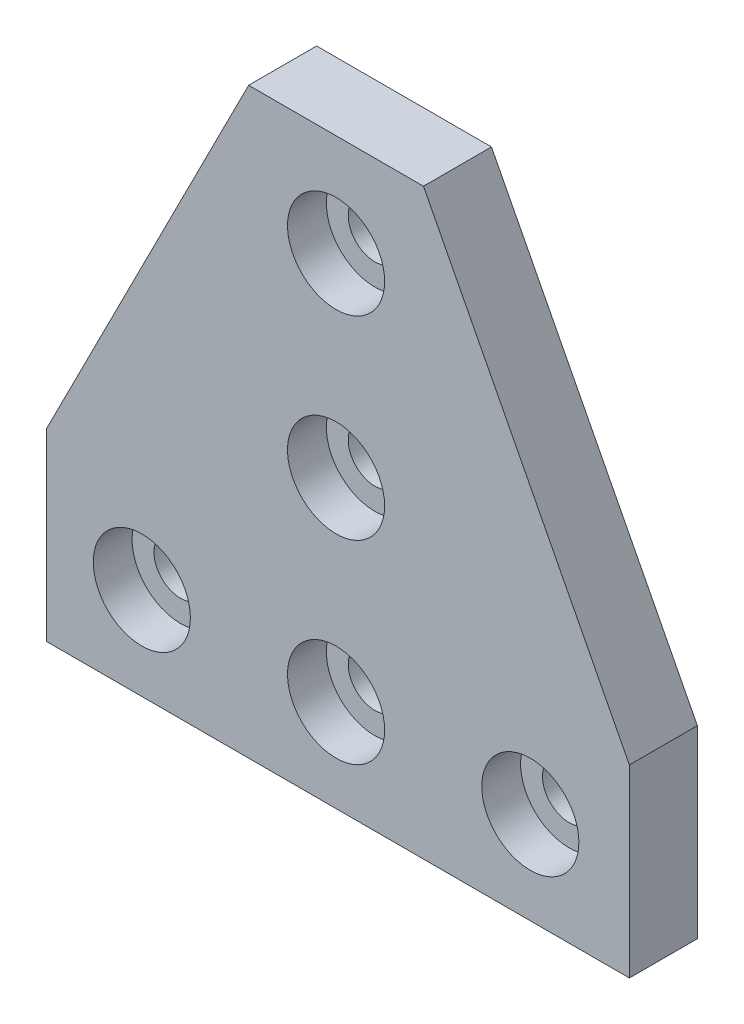
ISO-10303-21;
HEADER;
FILE_DESCRIPTION(('STEP AP214'),'2;1');
FILE_NAME('part.step','',(''),(''),'','','');
FILE_SCHEMA(('AUTOMOTIVE_DESIGN { 1 0 10303 214 1 1 1 1 }'));
ENDSEC;
DATA;
#1=APPLICATION_CONTEXT('core data for automotive mechanical design processes');
#2=APPLICATION_PROTOCOL_DEFINITION('international standard','automotive_design',2000,#1);
#3=PRODUCT_CONTEXT('',#1,'mechanical');
#4=PRODUCT('Part','Part','',(#3));
#5=PRODUCT_RELATED_PRODUCT_CATEGORY('part','',(#4));
#6=PRODUCT_DEFINITION_FORMATION('','',#4);
#7=PRODUCT_DEFINITION_CONTEXT('part definition',#1,'design');
#8=PRODUCT_DEFINITION('design','',#6,#7);
#9=PRODUCT_DEFINITION_SHAPE('','',#8);
#10=(LENGTH_UNIT() NAMED_UNIT(*) SI_UNIT(.MILLI.,.METRE.));
#11=(NAMED_UNIT(*) PLANE_ANGLE_UNIT() SI_UNIT($,.RADIAN.));
#12=(NAMED_UNIT(*) SI_UNIT($,.STERADIAN.) SOLID_ANGLE_UNIT());
#13=UNCERTAINTY_MEASURE_WITH_UNIT(LENGTH_MEASURE(1.E-05),#10,'distance_accuracy_value','');
#14=(GEOMETRIC_REPRESENTATION_CONTEXT(3) GLOBAL_UNCERTAINTY_ASSIGNED_CONTEXT((#13)) GLOBAL_UNIT_ASSIGNED_CONTEXT((#10,
#11,#12)) REPRESENTATION_CONTEXT('',''));
#15=CARTESIAN_POINT('',(0.,0.,0.));
#16=DIRECTION('',(0.,0.,1.));
#17=DIRECTION('',(1.,0.,0.));
#18=AXIS2_PLACEMENT_3D('',#15,#16,#17);
#19=CARTESIAN_POINT('',(0.200065786,20.5,0.));
#20=DIRECTION('',(0.,0.,1.));
#21=DIRECTION('',(1.,0.,0.));
#22=AXIS2_PLACEMENT_3D('',#19,#20,#21);
#23=PLANE('',#22);
#24=CARTESIAN_POINT('',(-20.,0.,0.));
#25=DIRECTION('',(0.,0.,-1.));
#26=DIRECTION('',(-1.,0.,0.));
#27=AXIS2_PLACEMENT_3D('',#24,#25,#26);
#28=CIRCLE('',#27,2.75);
#29=CARTESIAN_POINT('',(-17.25,0.,0.));
#30=VERTEX_POINT('',#29);
#31=EDGE_CURVE('E207',#30,#30,#28,.T.);
#32=ORIENTED_EDGE('',*,*,#31,.F.);
#33=EDGE_LOOP('',(#32));
#34=FACE_BOUND('',#33,.T.);
#35=CARTESIAN_POINT('',(0.,0.,0.));
#36=DIRECTION('',(0.,0.,-1.));
#37=DIRECTION('',(-1.,0.,0.));
#38=AXIS2_PLACEMENT_3D('',#35,#36,#37);
#39=CIRCLE('',#38,2.75);
#40=CARTESIAN_POINT('',(2.75,0.,0.));
#41=VERTEX_POINT('',#40);
#42=EDGE_CURVE('E305',#41,#41,#39,.T.);
#43=ORIENTED_EDGE('',*,*,#42,.F.);
#44=EDGE_LOOP('',(#43));
#45=FACE_BOUND('',#44,.T.);
#46=CARTESIAN_POINT('',(20.,0.,0.));
#47=DIRECTION('',(0.,0.,-1.));
#48=DIRECTION('',(-1.,0.,0.));
#49=AXIS2_PLACEMENT_3D('',#46,#47,#48);
#50=CIRCLE('',#49,2.75);
#51=CARTESIAN_POINT('',(22.75,0.,0.));
#52=VERTEX_POINT('',#51);
#53=EDGE_CURVE('E20',#52,#52,#50,.T.);
#54=ORIENTED_EDGE('',*,*,#53,.F.);
#55=EDGE_LOOP('',(#54));
#56=FACE_BOUND('',#55,.T.);
#57=CARTESIAN_POINT('',(0.,40.,0.));
#58=DIRECTION('',(0.,0.,-1.));
#59=DIRECTION('',(-1.,0.,0.));
#60=AXIS2_PLACEMENT_3D('',#57,#58,#59);
#61=CIRCLE('',#60,2.75);
#62=CARTESIAN_POINT('',(2.75,40.,0.));
#63=VERTEX_POINT('',#62);
#64=EDGE_CURVE('E256',#63,#63,#61,.T.);
#65=ORIENTED_EDGE('',*,*,#64,.F.);
#66=EDGE_LOOP('',(#65));
#67=FACE_BOUND('',#66,.T.);
#68=CARTESIAN_POINT('',(0.,20.,0.));
#69=DIRECTION('',(0.,0.,-1.));
#70=DIRECTION('',(-1.,0.,0.));
#71=AXIS2_PLACEMENT_3D('',#68,#69,#70);
#72=CIRCLE('',#71,2.75);
#73=CARTESIAN_POINT('',(2.75,20.,0.));
#74=VERTEX_POINT('',#73);
#75=EDGE_CURVE('E216',#74,#74,#72,.T.);
#76=ORIENTED_EDGE('',*,*,#75,.F.);
#77=EDGE_LOOP('',(#76));
#78=FACE_BOUND('',#77,.T.);
#79=DIRECTION('',(1.,0.,0.));
#80=VECTOR('',#79,1.);
#81=CARTESIAN_POINT('',(-29.799934214,-9.5,0.));
#82=LINE('',#81,#80);
#83=CARTESIAN_POINT('',(-29.799934214,-9.5,0.));
#84=VERTEX_POINT('',#83);
#85=CARTESIAN_POINT('',(30.200065786,-9.5,0.));
#86=VERTEX_POINT('',#85);
#87=EDGE_CURVE('E27',#84,#86,#82,.T.);
#88=ORIENTED_EDGE('',*,*,#87,.F.);
#89=DIRECTION('',(0.,-1.,0.));
#90=VECTOR('',#89,1.);
#91=CARTESIAN_POINT('',(-29.799934214,9.5,0.));
#92=LINE('',#91,#90);
#93=CARTESIAN_POINT('',(-29.799934214,9.5,0.));
#94=VERTEX_POINT('',#93);
#95=EDGE_CURVE('E208',#94,#84,#92,.T.);
#96=ORIENTED_EDGE('',*,*,#95,.F.);
#97=DIRECTION('',(-0.452425144121183,-0.891802382238872,0.));
#98=VECTOR('',#97,1.);
#99=CARTESIAN_POINT('',(-9.,50.5,0.));
#100=LINE('',#99,#98);
#101=CARTESIAN_POINT('',(-9.,50.5,0.));
#102=VERTEX_POINT('',#101);
#103=EDGE_CURVE('E276',#102,#94,#100,.T.);
#104=ORIENTED_EDGE('',*,*,#103,.F.);
#105=DIRECTION('',(-1.,0.,0.));
#106=VECTOR('',#105,1.);
#107=CARTESIAN_POINT('',(9.,50.5,0.));
#108=LINE('',#107,#106);
#109=CARTESIAN_POINT('',(9.,50.5,0.));
#110=VERTEX_POINT('',#109);
#111=EDGE_CURVE('E221',#110,#102,#108,.T.);
#112=ORIENTED_EDGE('',*,*,#111,.F.);
#113=DIRECTION('',(-0.459306160768736,0.888278025552746,0.));
#114=VECTOR('',#113,1.);
#115=CARTESIAN_POINT('',(30.200065786,9.5,0.));
#116=LINE('',#115,#114);
#117=CARTESIAN_POINT('',(30.200065786,9.5,0.));
#118=VERTEX_POINT('',#117);
#119=EDGE_CURVE('E182',#118,#110,#116,.T.);
#120=ORIENTED_EDGE('',*,*,#119,.F.);
#121=DIRECTION('',(0.,1.,0.));
#122=VECTOR('',#121,1.);
#123=CARTESIAN_POINT('',(30.200065786,-9.5,0.));
#124=LINE('',#123,#122);
#125=EDGE_CURVE('E242',#86,#118,#124,.T.);
#126=ORIENTED_EDGE('',*,*,#125,.F.);
#127=EDGE_LOOP('',(#88,#96,#104,#112,#120,#126));
#128=FACE_BOUND('',#127,.T.);
#129=ADVANCED_FACE('F16',(#34,#45,#56,#67,#78,#128),#23,.F.);
#130=CARTESIAN_POINT('',(0.200065786,20.5,7.));
#131=DIRECTION('',(0.,0.,1.));
#132=DIRECTION('',(1.,0.,0.));
#133=AXIS2_PLACEMENT_3D('',#130,#131,#132);
#134=PLANE('',#133);
#135=DIRECTION('',(-1.,0.,0.));
#136=VECTOR('',#135,1.);
#137=CARTESIAN_POINT('',(-29.799934214,-9.5,7.));
#138=LINE('',#137,#136);
#139=CARTESIAN_POINT('',(30.200065786,-9.5,7.));
#140=VERTEX_POINT('',#139);
#141=CARTESIAN_POINT('',(-29.799934214,-9.5,7.));
#142=VERTEX_POINT('',#141);
#143=EDGE_CURVE('E10',#140,#142,#138,.T.);
#144=ORIENTED_EDGE('',*,*,#143,.F.);
#145=DIRECTION('',(0.,-1.,0.));
#146=VECTOR('',#145,1.);
#147=CARTESIAN_POINT('',(30.200065786,-9.5,7.));
#148=LINE('',#147,#146);
#149=CARTESIAN_POINT('',(30.200065786,9.5,7.));
#150=VERTEX_POINT('',#149);
#151=EDGE_CURVE('E233',#150,#140,#148,.T.);
#152=ORIENTED_EDGE('',*,*,#151,.F.);
#153=DIRECTION('',(0.459306160768736,-0.888278025552746,0.));
#154=VECTOR('',#153,1.);
#155=CARTESIAN_POINT('',(30.200065786,9.5,7.));
#156=LINE('',#155,#154);
#157=CARTESIAN_POINT('',(9.,50.5,7.));
#158=VERTEX_POINT('',#157);
#159=EDGE_CURVE('E185',#158,#150,#156,.T.);
#160=ORIENTED_EDGE('',*,*,#159,.F.);
#161=DIRECTION('',(1.,0.,0.));
#162=VECTOR('',#161,1.);
#163=CARTESIAN_POINT('',(9.,50.5,7.));
#164=LINE('',#163,#162);
#165=CARTESIAN_POINT('',(-9.,50.5,7.));
#166=VERTEX_POINT('',#165);
#167=EDGE_CURVE('E265',#166,#158,#164,.T.);
#168=ORIENTED_EDGE('',*,*,#167,.F.);
#169=DIRECTION('',(0.452425144121183,0.891802382238872,0.));
#170=VECTOR('',#169,1.);
#171=CARTESIAN_POINT('',(-9.,50.5,7.));
#172=LINE('',#171,#170);
#173=CARTESIAN_POINT('',(-29.799934214,9.5,7.));
#174=VERTEX_POINT('',#173);
#175=EDGE_CURVE('E222',#174,#166,#172,.T.);
#176=ORIENTED_EDGE('',*,*,#175,.F.);
#177=DIRECTION('',(0.,1.,0.));
#178=VECTOR('',#177,1.);
#179=CARTESIAN_POINT('',(-29.799934214,9.5,7.));
#180=LINE('',#179,#178);
#181=EDGE_CURVE('E229',#142,#174,#180,.T.);
#182=ORIENTED_EDGE('',*,*,#181,.F.);
#183=EDGE_LOOP('',(#144,#152,#160,#168,#176,#182));
#184=FACE_BOUND('',#183,.T.);
#185=CARTESIAN_POINT('',(0.,40.,7.));
#186=DIRECTION('',(0.,0.,1.));
#187=DIRECTION('',(1.,0.,0.));
#188=AXIS2_PLACEMENT_3D('',#185,#186,#187);
#189=CIRCLE('',#188,5.);
#190=CARTESIAN_POINT('',(5.,40.,7.));
#191=VERTEX_POINT('',#190);
#192=EDGE_CURVE('E162',#191,#191,#189,.T.);
#193=ORIENTED_EDGE('',*,*,#192,.F.);
#194=EDGE_LOOP('',(#193));
#195=FACE_BOUND('',#194,.T.);
#196=CARTESIAN_POINT('',(-20.,0.,7.));
#197=DIRECTION('',(0.,0.,1.));
#198=DIRECTION('',(1.,0.,0.));
#199=AXIS2_PLACEMENT_3D('',#196,#197,#198);
#200=CIRCLE('',#199,5.);
#201=CARTESIAN_POINT('',(-15.,0.,7.));
#202=VERTEX_POINT('',#201);
#203=EDGE_CURVE('E197',#202,#202,#200,.T.);
#204=ORIENTED_EDGE('',*,*,#203,.F.);
#205=EDGE_LOOP('',(#204));
#206=FACE_BOUND('',#205,.T.);
#207=CARTESIAN_POINT('',(0.,20.,7.));
#208=DIRECTION('',(0.,0.,1.));
#209=DIRECTION('',(1.,0.,0.));
#210=AXIS2_PLACEMENT_3D('',#207,#208,#209);
#211=CIRCLE('',#210,5.);
#212=CARTESIAN_POINT('',(5.,20.,7.));
#213=VERTEX_POINT('',#212);
#214=EDGE_CURVE('E295',#213,#213,#211,.T.);
#215=ORIENTED_EDGE('',*,*,#214,.F.);
#216=EDGE_LOOP('',(#215));
#217=FACE_BOUND('',#216,.T.);
#218=CARTESIAN_POINT('',(20.,0.,7.));
#219=DIRECTION('',(0.,0.,1.));
#220=DIRECTION('',(1.,0.,0.));
#221=AXIS2_PLACEMENT_3D('',#218,#219,#220);
#222=CIRCLE('',#221,5.);
#223=CARTESIAN_POINT('',(25.,0.,7.));
#224=VERTEX_POINT('',#223);
#225=EDGE_CURVE('E338',#224,#224,#222,.T.);
#226=ORIENTED_EDGE('',*,*,#225,.F.);
#227=EDGE_LOOP('',(#226));
#228=FACE_BOUND('',#227,.T.);
#229=CARTESIAN_POINT('',(0.,0.,7.));
#230=DIRECTION('',(0.,0.,1.));
#231=DIRECTION('',(1.,0.,0.));
#232=AXIS2_PLACEMENT_3D('',#229,#230,#231);
#233=CIRCLE('',#232,5.);
#234=CARTESIAN_POINT('',(5.,0.,7.));
#235=VERTEX_POINT('',#234);
#236=EDGE_CURVE('E330',#235,#235,#233,.T.);
#237=ORIENTED_EDGE('',*,*,#236,.F.);
#238=EDGE_LOOP('',(#237));
#239=FACE_BOUND('',#238,.T.);
#240=ADVANCED_FACE('F385',(#184,#195,#206,#217,#228,#239),#134,.T.);
#241=CARTESIAN_POINT('',(-29.799934214,-9.5,0.));
#242=DIRECTION('',(0.,-1.,0.));
#243=DIRECTION('',(0.,0.,-1.));
#244=AXIS2_PLACEMENT_3D('',#241,#242,#243);
#245=PLANE('',#244);
#246=ORIENTED_EDGE('',*,*,#87,.T.);
#247=DIRECTION('',(0.,0.,-1.));
#248=VECTOR('',#247,1.);
#249=CARTESIAN_POINT('',(30.200065786,-9.5,0.));
#250=LINE('',#249,#248);
#251=EDGE_CURVE('E230',#140,#86,#250,.T.);
#252=ORIENTED_EDGE('',*,*,#251,.F.);
#253=ORIENTED_EDGE('',*,*,#143,.T.);
#254=DIRECTION('',(0.,0.,1.));
#255=VECTOR('',#254,1.);
#256=CARTESIAN_POINT('',(-29.799934214,-9.5,0.));
#257=LINE('',#256,#255);
#258=EDGE_CURVE('E215',#84,#142,#257,.T.);
#259=ORIENTED_EDGE('',*,*,#258,.F.);
#260=EDGE_LOOP('',(#246,#252,#253,#259));
#261=FACE_BOUND('',#260,.T.);
#262=ADVANCED_FACE('F393',(#261),#245,.T.);
#263=CARTESIAN_POINT('',(30.200065786,-9.5,0.));
#264=DIRECTION('',(1.,0.,0.));
#265=DIRECTION('',(0.,1.,0.));
#266=AXIS2_PLACEMENT_3D('',#263,#264,#265);
#267=PLANE('',#266);
#268=ORIENTED_EDGE('',*,*,#125,.T.);
#269=DIRECTION('',(0.,0.,-1.));
#270=VECTOR('',#269,1.);
#271=CARTESIAN_POINT('',(30.200065786,9.5,0.));
#272=LINE('',#271,#270);
#273=EDGE_CURVE('E248',#150,#118,#272,.T.);
#274=ORIENTED_EDGE('',*,*,#273,.F.);
#275=ORIENTED_EDGE('',*,*,#151,.T.);
#276=ORIENTED_EDGE('',*,*,#251,.T.);
#277=EDGE_LOOP('',(#268,#274,#275,#276));
#278=FACE_BOUND('',#277,.T.);
#279=ADVANCED_FACE('F408',(#278),#267,.T.);
#280=CARTESIAN_POINT('',(30.200065786,9.5,0.));
#281=DIRECTION('',(0.888278025552746,0.459306160768736,0.));
#282=DIRECTION('',(0.,0.,-1.));
#283=AXIS2_PLACEMENT_3D('',#280,#281,#282);
#284=PLANE('',#283);
#285=ORIENTED_EDGE('',*,*,#119,.T.);
#286=DIRECTION('',(0.,0.,-1.));
#287=VECTOR('',#286,1.);
#288=CARTESIAN_POINT('',(9.,50.5,0.));
#289=LINE('',#288,#287);
#290=EDGE_CURVE('E186',#158,#110,#289,.T.);
#291=ORIENTED_EDGE('',*,*,#290,.F.);
#292=ORIENTED_EDGE('',*,*,#159,.T.);
#293=ORIENTED_EDGE('',*,*,#273,.T.);
#294=EDGE_LOOP('',(#285,#291,#292,#293));
#295=FACE_BOUND('',#294,.T.);
#296=ADVANCED_FACE('F407',(#295),#284,.T.);
#297=CARTESIAN_POINT('',(9.,50.5,0.));
#298=DIRECTION('',(0.,1.,0.));
#299=DIRECTION('',(1.,0.,0.));
#300=AXIS2_PLACEMENT_3D('',#297,#298,#299);
#301=PLANE('',#300);
#302=ORIENTED_EDGE('',*,*,#111,.T.);
#303=DIRECTION('',(0.,0.,-1.));
#304=VECTOR('',#303,1.);
#305=CARTESIAN_POINT('',(-9.,50.5,0.));
#306=LINE('',#305,#304);
#307=EDGE_CURVE('E217',#166,#102,#306,.T.);
#308=ORIENTED_EDGE('',*,*,#307,.F.);
#309=ORIENTED_EDGE('',*,*,#167,.T.);
#310=ORIENTED_EDGE('',*,*,#290,.T.);
#311=EDGE_LOOP('',(#302,#308,#309,#310));
#312=FACE_BOUND('',#311,.T.);
#313=ADVANCED_FACE('F404',(#312),#301,.T.);
#314=CARTESIAN_POINT('',(-9.,50.5,0.));
#315=DIRECTION('',(-0.891802382238872,0.452425144121183,0.));
#316=DIRECTION('',(0.,0.,1.));
#317=AXIS2_PLACEMENT_3D('',#314,#315,#316);
#318=PLANE('',#317);
#319=ORIENTED_EDGE('',*,*,#103,.T.);
#320=DIRECTION('',(0.,0.,-1.));
#321=VECTOR('',#320,1.);
#322=CARTESIAN_POINT('',(-29.799934214,9.5,0.));
#323=LINE('',#322,#321);
#324=EDGE_CURVE('E274',#174,#94,#323,.T.);
#325=ORIENTED_EDGE('',*,*,#324,.F.);
#326=ORIENTED_EDGE('',*,*,#175,.T.);
#327=ORIENTED_EDGE('',*,*,#307,.T.);
#328=EDGE_LOOP('',(#319,#325,#326,#327));
#329=FACE_BOUND('',#328,.T.);
#330=ADVANCED_FACE('F18',(#329),#318,.T.);
#331=CARTESIAN_POINT('',(-29.799934214,9.5,0.));
#332=DIRECTION('',(-1.,0.,0.));
#333=DIRECTION('',(0.,1.,0.));
#334=AXIS2_PLACEMENT_3D('',#331,#332,#333);
#335=PLANE('',#334);
#336=ORIENTED_EDGE('',*,*,#95,.T.);
#337=ORIENTED_EDGE('',*,*,#258,.T.);
#338=ORIENTED_EDGE('',*,*,#181,.T.);
#339=ORIENTED_EDGE('',*,*,#324,.T.);
#340=EDGE_LOOP('',(#336,#337,#338,#339));
#341=FACE_BOUND('',#340,.T.);
#342=ADVANCED_FACE('F395',(#341),#335,.T.);
#343=CARTESIAN_POINT('',(0.,20.,0.));
#344=DIRECTION('',(0.,0.,1.));
#345=DIRECTION('',(-1.,0.,0.));
#346=AXIS2_PLACEMENT_3D('',#343,#344,#345);
#347=CYLINDRICAL_SURFACE('',#346,2.75);
#348=CARTESIAN_POINT('',(2.75,20.,0.));
#349=CARTESIAN_POINT('',(2.75,20.,3.));
#350=(BOUNDED_CURVE() B_SPLINE_CURVE(1,(#348,#349),.UNSPECIFIED.,.F.,
.F.) B_SPLINE_CURVE_WITH_KNOTS((2,2),(0.,3.),
.UNSPECIFIED.) CURVE() GEOMETRIC_REPRESENTATION_ITEM() RATIONAL_B_SPLINE_CURVE((1.,1.)) REPRESENTATION_ITEM(''));
#351=CARTESIAN_POINT('',(2.75,20.,3.));
#352=VERTEX_POINT('',#351);
#353=EDGE_CURVE('E259',#74,#352,#350,.T.);
#354=ORIENTED_EDGE('',*,*,#353,.F.);
#355=ORIENTED_EDGE('',*,*,#75,.T.);
#356=ORIENTED_EDGE('',*,*,#353,.T.);
#357=CARTESIAN_POINT('',(0.,20.,3.));
#358=DIRECTION('',(0.,0.,-1.));
#359=DIRECTION('',(-1.,0.,0.));
#360=AXIS2_PLACEMENT_3D('',#357,#358,#359);
#361=CIRCLE('',#360,2.75);
#362=EDGE_CURVE('E198',#352,#352,#361,.T.);
#363=ORIENTED_EDGE('',*,*,#362,.F.);
#364=EDGE_LOOP('',(#354,#355,#356,#363));
#365=FACE_BOUND('',#364,.T.);
#366=ADVANCED_FACE('F380',(#365),#347,.F.);
#367=CARTESIAN_POINT('',(0.,40.,0.));
#368=DIRECTION('',(0.,0.,1.));
#369=DIRECTION('',(-1.,0.,0.));
#370=AXIS2_PLACEMENT_3D('',#367,#368,#369);
#371=CYLINDRICAL_SURFACE('',#370,2.75);
#372=CARTESIAN_POINT('',(2.75,40.,0.));
#373=CARTESIAN_POINT('',(2.75,40.,3.));
#374=(BOUNDED_CURVE() B_SPLINE_CURVE(1,(#372,#373),.UNSPECIFIED.,.F.,
.F.) B_SPLINE_CURVE_WITH_KNOTS((2,2),(0.,3.),
.UNSPECIFIED.) CURVE() GEOMETRIC_REPRESENTATION_ITEM() RATIONAL_B_SPLINE_CURVE((1.,1.)) REPRESENTATION_ITEM(''));
#375=CARTESIAN_POINT('',(2.75,40.,3.));
#376=VERTEX_POINT('',#375);
#377=EDGE_CURVE('E260',#63,#376,#374,.T.);
#378=ORIENTED_EDGE('',*,*,#377,.F.);
#379=ORIENTED_EDGE('',*,*,#64,.T.);
#380=ORIENTED_EDGE('',*,*,#377,.T.);
#381=CARTESIAN_POINT('',(0.,40.,3.));
#382=DIRECTION('',(0.,0.,-1.));
#383=DIRECTION('',(-1.,0.,0.));
#384=AXIS2_PLACEMENT_3D('',#381,#382,#383);
#385=CIRCLE('',#384,2.75);
#386=EDGE_CURVE('E174',#376,#376,#385,.T.);
#387=ORIENTED_EDGE('',*,*,#386,.F.);
#388=EDGE_LOOP('',(#378,#379,#380,#387));
#389=FACE_BOUND('',#388,.T.);
#390=ADVANCED_FACE('F459',(#389),#371,.F.);
#391=CARTESIAN_POINT('',(20.,0.,0.));
#392=DIRECTION('',(0.,0.,1.));
#393=DIRECTION('',(-1.,0.,0.));
#394=AXIS2_PLACEMENT_3D('',#391,#392,#393);
#395=CYLINDRICAL_SURFACE('',#394,2.75);
#396=CARTESIAN_POINT('',(22.75,0.,0.));
#397=CARTESIAN_POINT('',(22.75,0.,3.));
#398=(BOUNDED_CURVE() B_SPLINE_CURVE(1,(#396,#397),.UNSPECIFIED.,.F.,
.F.) B_SPLINE_CURVE_WITH_KNOTS((2,2),(0.,3.),
.UNSPECIFIED.) CURVE() GEOMETRIC_REPRESENTATION_ITEM() RATIONAL_B_SPLINE_CURVE((1.,1.)) REPRESENTATION_ITEM(''));
#399=CARTESIAN_POINT('',(22.75,0.,3.));
#400=VERTEX_POINT('',#399);
#401=EDGE_CURVE('E313',#52,#400,#398,.T.);
#402=ORIENTED_EDGE('',*,*,#401,.F.);
#403=ORIENTED_EDGE('',*,*,#53,.T.);
#404=ORIENTED_EDGE('',*,*,#401,.T.);
#405=CARTESIAN_POINT('',(20.,0.,3.));
#406=DIRECTION('',(0.,0.,-1.));
#407=DIRECTION('',(-1.,0.,0.));
#408=AXIS2_PLACEMENT_3D('',#405,#406,#407);
#409=CIRCLE('',#408,2.75);
#410=EDGE_CURVE('E296',#400,#400,#409,.T.);
#411=ORIENTED_EDGE('',*,*,#410,.F.);
#412=EDGE_LOOP('',(#402,#403,#404,#411));
#413=FACE_BOUND('',#412,.T.);
#414=ADVANCED_FACE('F480',(#413),#395,.F.);
#415=CARTESIAN_POINT('',(0.,0.,0.));
#416=DIRECTION('',(0.,0.,1.));
#417=DIRECTION('',(-1.,0.,0.));
#418=AXIS2_PLACEMENT_3D('',#415,#416,#417);
#419=CYLINDRICAL_SURFACE('',#418,2.75);
#420=CARTESIAN_POINT('',(2.75,0.,0.));
#421=CARTESIAN_POINT('',(2.75,0.,3.));
#422=(BOUNDED_CURVE() B_SPLINE_CURVE(1,(#420,#421),.UNSPECIFIED.,.F.,
.F.) B_SPLINE_CURVE_WITH_KNOTS((2,2),(0.,3.),
.UNSPECIFIED.) CURVE() GEOMETRIC_REPRESENTATION_ITEM() RATIONAL_B_SPLINE_CURVE((1.,1.)) REPRESENTATION_ITEM(''));
#423=CARTESIAN_POINT('',(2.75,0.,3.));
#424=VERTEX_POINT('',#423);
#425=EDGE_CURVE('E297',#41,#424,#422,.T.);
#426=ORIENTED_EDGE('',*,*,#425,.F.);
#427=ORIENTED_EDGE('',*,*,#42,.T.);
#428=ORIENTED_EDGE('',*,*,#425,.T.);
#429=CARTESIAN_POINT('',(0.,0.,3.));
#430=DIRECTION('',(0.,0.,-1.));
#431=DIRECTION('',(-1.,0.,0.));
#432=AXIS2_PLACEMENT_3D('',#429,#430,#431);
#433=CIRCLE('',#432,2.75);
#434=EDGE_CURVE('E284',#424,#424,#433,.T.);
#435=ORIENTED_EDGE('',*,*,#434,.F.);
#436=EDGE_LOOP('',(#426,#427,#428,#435));
#437=FACE_BOUND('',#436,.T.);
#438=ADVANCED_FACE('F448',(#437),#419,.F.);
#439=CARTESIAN_POINT('',(-20.,0.,0.));
#440=DIRECTION('',(0.,0.,1.));
#441=DIRECTION('',(-1.,0.,0.));
#442=AXIS2_PLACEMENT_3D('',#439,#440,#441);
#443=CYLINDRICAL_SURFACE('',#442,2.75);
#444=CARTESIAN_POINT('',(-17.25,0.,0.));
#445=CARTESIAN_POINT('',(-17.25,0.,3.));
#446=(BOUNDED_CURVE() B_SPLINE_CURVE(1,(#444,#445),.UNSPECIFIED.,.F.,
.F.) B_SPLINE_CURVE_WITH_KNOTS((2,2),(0.,3.),
.UNSPECIFIED.) CURVE() GEOMETRIC_REPRESENTATION_ITEM() RATIONAL_B_SPLINE_CURVE((1.,1.)) REPRESENTATION_ITEM(''));
#447=CARTESIAN_POINT('',(-17.25,0.,3.));
#448=VERTEX_POINT('',#447);
#449=EDGE_CURVE('E199',#30,#448,#446,.T.);
#450=ORIENTED_EDGE('',*,*,#449,.F.);
#451=ORIENTED_EDGE('',*,*,#31,.T.);
#452=ORIENTED_EDGE('',*,*,#449,.T.);
#453=CARTESIAN_POINT('',(-20.,0.,3.));
#454=DIRECTION('',(0.,0.,-1.));
#455=DIRECTION('',(-1.,0.,0.));
#456=AXIS2_PLACEMENT_3D('',#453,#454,#455);
#457=CIRCLE('',#456,2.75);
#458=EDGE_CURVE('E176',#448,#448,#457,.T.);
#459=ORIENTED_EDGE('',*,*,#458,.F.);
#460=EDGE_LOOP('',(#450,#451,#452,#459));
#461=FACE_BOUND('',#460,.T.);
#462=ADVANCED_FACE('F463',(#461),#443,.F.);
#463=CARTESIAN_POINT('',(0.,40.,3.));
#464=DIRECTION('',(0.,0.,1.));
#465=DIRECTION('',(1.,0.,0.));
#466=AXIS2_PLACEMENT_3D('',#463,#464,#465);
#467=PLANE('',#466);
#468=CARTESIAN_POINT('',(0.,40.,3.));
#469=DIRECTION('',(0.,0.,-1.));
#470=DIRECTION('',(1.,0.,0.));
#471=AXIS2_PLACEMENT_3D('',#468,#469,#470);
#472=CIRCLE('',#471,5.);
#473=CARTESIAN_POINT('',(5.,40.,3.));
#474=VERTEX_POINT('',#473);
#475=EDGE_CURVE('E167',#474,#474,#472,.T.);
#476=ORIENTED_EDGE('',*,*,#475,.F.);
#477=EDGE_LOOP('',(#476));
#478=FACE_BOUND('',#477,.T.);
#479=ORIENTED_EDGE('',*,*,#386,.T.);
#480=EDGE_LOOP('',(#479));
#481=FACE_BOUND('',#480,.T.);
#482=ADVANCED_FACE('F461',(#478,#481),#467,.T.);
#483=CARTESIAN_POINT('',(0.,40.,7.));
#484=DIRECTION('',(0.,0.,-1.));
#485=DIRECTION('',(1.,0.,0.));
#486=AXIS2_PLACEMENT_3D('',#483,#484,#485);
#487=CYLINDRICAL_SURFACE('',#486,5.);
#488=CARTESIAN_POINT('',(5.,40.,7.));
#489=CARTESIAN_POINT('',(5.,40.,3.));
#490=(BOUNDED_CURVE() B_SPLINE_CURVE(1,(#488,#489),.UNSPECIFIED.,.F.,
.F.) B_SPLINE_CURVE_WITH_KNOTS((2,2),(0.,4.),
.UNSPECIFIED.) CURVE() GEOMETRIC_REPRESENTATION_ITEM() RATIONAL_B_SPLINE_CURVE((1.,1.)) REPRESENTATION_ITEM(''));
#491=EDGE_CURVE('E164',#191,#474,#490,.T.);
#492=ORIENTED_EDGE('',*,*,#491,.F.);
#493=ORIENTED_EDGE('',*,*,#192,.T.);
#494=ORIENTED_EDGE('',*,*,#491,.T.);
#495=ORIENTED_EDGE('',*,*,#475,.T.);
#496=EDGE_LOOP('',(#492,#493,#494,#495));
#497=FACE_BOUND('',#496,.T.);
#498=ADVANCED_FACE('F163',(#497),#487,.F.);
#499=CARTESIAN_POINT('',(-20.,0.,3.));
#500=DIRECTION('',(0.,0.,1.));
#501=DIRECTION('',(1.,0.,0.));
#502=AXIS2_PLACEMENT_3D('',#499,#500,#501);
#503=PLANE('',#502);
#504=ORIENTED_EDGE('',*,*,#458,.T.);
#505=EDGE_LOOP('',(#504));
#506=FACE_BOUND('',#505,.T.);
#507=CARTESIAN_POINT('',(-20.,0.,3.));
#508=DIRECTION('',(0.,0.,-1.));
#509=DIRECTION('',(1.,0.,0.));
#510=AXIS2_PLACEMENT_3D('',#507,#508,#509);
#511=CIRCLE('',#510,5.);
#512=CARTESIAN_POINT('',(-15.,0.,3.));
#513=VERTEX_POINT('',#512);
#514=EDGE_CURVE('E190',#513,#513,#511,.T.);
#515=ORIENTED_EDGE('',*,*,#514,.F.);
#516=EDGE_LOOP('',(#515));
#517=FACE_BOUND('',#516,.T.);
#518=ADVANCED_FACE('F426',(#506,#517),#503,.T.);
#519=CARTESIAN_POINT('',(-20.,0.,7.));
#520=DIRECTION('',(0.,0.,-1.));
#521=DIRECTION('',(1.,0.,0.));
#522=AXIS2_PLACEMENT_3D('',#519,#520,#521);
#523=CYLINDRICAL_SURFACE('',#522,5.);
#524=CARTESIAN_POINT('',(-15.,0.,7.));
#525=CARTESIAN_POINT('',(-15.,0.,3.));
#526=(BOUNDED_CURVE() B_SPLINE_CURVE(1,(#524,#525),.UNSPECIFIED.,.F.,
.F.) B_SPLINE_CURVE_WITH_KNOTS((2,2),(0.,4.),
.UNSPECIFIED.) CURVE() GEOMETRIC_REPRESENTATION_ITEM() RATIONAL_B_SPLINE_CURVE((1.,1.)) REPRESENTATION_ITEM(''));
#527=EDGE_CURVE('E191',#202,#513,#526,.T.);
#528=ORIENTED_EDGE('',*,*,#527,.F.);
#529=ORIENTED_EDGE('',*,*,#203,.T.);
#530=ORIENTED_EDGE('',*,*,#527,.T.);
#531=ORIENTED_EDGE('',*,*,#514,.T.);
#532=EDGE_LOOP('',(#528,#529,#530,#531));
#533=FACE_BOUND('',#532,.T.);
#534=ADVANCED_FACE('F424',(#533),#523,.F.);
#535=CARTESIAN_POINT('',(0.,20.,3.));
#536=DIRECTION('',(0.,0.,1.));
#537=DIRECTION('',(1.,0.,0.));
#538=AXIS2_PLACEMENT_3D('',#535,#536,#537);
#539=PLANE('',#538);
#540=ORIENTED_EDGE('',*,*,#362,.T.);
#541=EDGE_LOOP('',(#540));
#542=FACE_BOUND('',#541,.T.);
#543=CARTESIAN_POINT('',(0.,20.,3.));
#544=DIRECTION('',(0.,0.,-1.));
#545=DIRECTION('',(1.,0.,0.));
#546=AXIS2_PLACEMENT_3D('',#543,#544,#545);
#547=CIRCLE('',#546,5.);
#548=CARTESIAN_POINT('',(5.,20.,3.));
#549=VERTEX_POINT('',#548);
#550=EDGE_CURVE('E226',#549,#549,#547,.T.);
#551=ORIENTED_EDGE('',*,*,#550,.F.);
#552=EDGE_LOOP('',(#551));
#553=FACE_BOUND('',#552,.T.);
#554=ADVANCED_FACE('F420',(#542,#553),#539,.T.);
#555=CARTESIAN_POINT('',(0.,20.,7.));
#556=DIRECTION('',(0.,0.,-1.));
#557=DIRECTION('',(1.,0.,0.));
#558=AXIS2_PLACEMENT_3D('',#555,#556,#557);
#559=CYLINDRICAL_SURFACE('',#558,5.);
#560=CARTESIAN_POINT('',(5.,20.,7.));
#561=CARTESIAN_POINT('',(5.,20.,3.));
#562=(BOUNDED_CURVE() B_SPLINE_CURVE(1,(#560,#561),.UNSPECIFIED.,.F.,
.F.) B_SPLINE_CURVE_WITH_KNOTS((2,2),(0.,4.),
.UNSPECIFIED.) CURVE() GEOMETRIC_REPRESENTATION_ITEM() RATIONAL_B_SPLINE_CURVE((1.,1.)) REPRESENTATION_ITEM(''));
#563=EDGE_CURVE('E289',#213,#549,#562,.T.);
#564=ORIENTED_EDGE('',*,*,#563,.F.);
#565=ORIENTED_EDGE('',*,*,#214,.T.);
#566=ORIENTED_EDGE('',*,*,#563,.T.);
#567=ORIENTED_EDGE('',*,*,#550,.T.);
#568=EDGE_LOOP('',(#564,#565,#566,#567));
#569=FACE_BOUND('',#568,.T.);
#570=ADVANCED_FACE('F423',(#569),#559,.F.);
#571=CARTESIAN_POINT('',(20.,0.,3.));
#572=DIRECTION('',(0.,0.,1.));
#573=DIRECTION('',(1.,0.,0.));
#574=AXIS2_PLACEMENT_3D('',#571,#572,#573);
#575=PLANE('',#574);
#576=CARTESIAN_POINT('',(20.,0.,3.));
#577=DIRECTION('',(0.,0.,-1.));
#578=DIRECTION('',(1.,0.,0.));
#579=AXIS2_PLACEMENT_3D('',#576,#577,#578);
#580=CIRCLE('',#579,5.);
#581=CARTESIAN_POINT('',(25.,0.,3.));
#582=VERTEX_POINT('',#581);
#583=EDGE_CURVE('E341',#582,#582,#580,.T.);
#584=ORIENTED_EDGE('',*,*,#583,.F.);
#585=EDGE_LOOP('',(#584));
#586=FACE_BOUND('',#585,.T.);
#587=ORIENTED_EDGE('',*,*,#410,.T.);
#588=EDGE_LOOP('',(#587));
#589=FACE_BOUND('',#588,.T.);
#590=ADVANCED_FACE('F433',(#586,#589),#575,.T.);
#591=CARTESIAN_POINT('',(20.,0.,7.));
#592=DIRECTION('',(0.,0.,-1.));
#593=DIRECTION('',(1.,0.,0.));
#594=AXIS2_PLACEMENT_3D('',#591,#592,#593);
#595=CYLINDRICAL_SURFACE('',#594,5.);
#596=CARTESIAN_POINT('',(25.,0.,7.));
#597=CARTESIAN_POINT('',(25.,0.,3.));
#598=(BOUNDED_CURVE() B_SPLINE_CURVE(1,(#596,#597),.UNSPECIFIED.,.F.,
.F.) B_SPLINE_CURVE_WITH_KNOTS((2,2),(0.,4.),
.UNSPECIFIED.) CURVE() GEOMETRIC_REPRESENTATION_ITEM() RATIONAL_B_SPLINE_CURVE((1.,1.)) REPRESENTATION_ITEM(''));
#599=EDGE_CURVE('E252',#224,#582,#598,.T.);
#600=ORIENTED_EDGE('',*,*,#599,.F.);
#601=ORIENTED_EDGE('',*,*,#225,.T.);
#602=ORIENTED_EDGE('',*,*,#599,.T.);
#603=ORIENTED_EDGE('',*,*,#583,.T.);
#604=EDGE_LOOP('',(#600,#601,#602,#603));
#605=FACE_BOUND('',#604,.T.);
#606=ADVANCED_FACE('F430',(#605),#595,.F.);
#607=CARTESIAN_POINT('',(0.,0.,3.));
#608=DIRECTION('',(0.,0.,1.));
#609=DIRECTION('',(1.,0.,0.));
#610=AXIS2_PLACEMENT_3D('',#607,#608,#609);
#611=PLANE('',#610);
#612=CARTESIAN_POINT('',(0.,0.,3.));
#613=DIRECTION('',(0.,0.,-1.));
#614=DIRECTION('',(1.,0.,0.));
#615=AXIS2_PLACEMENT_3D('',#612,#613,#614);
#616=CIRCLE('',#615,5.);
#617=CARTESIAN_POINT('',(5.,0.,3.));
#618=VERTEX_POINT('',#617);
#619=EDGE_CURVE('E288',#618,#618,#616,.T.);
#620=ORIENTED_EDGE('',*,*,#619,.F.);
#621=EDGE_LOOP('',(#620));
#622=FACE_BOUND('',#621,.T.);
#623=ORIENTED_EDGE('',*,*,#434,.T.);
#624=EDGE_LOOP('',(#623));
#625=FACE_BOUND('',#624,.T.);
#626=ADVANCED_FACE('F432',(#622,#625),#611,.T.);
#627=CARTESIAN_POINT('',(0.,0.,7.));
#628=DIRECTION('',(0.,0.,-1.));
#629=DIRECTION('',(1.,0.,0.));
#630=AXIS2_PLACEMENT_3D('',#627,#628,#629);
#631=CYLINDRICAL_SURFACE('',#630,5.);
#632=CARTESIAN_POINT('',(5.,0.,7.));
#633=CARTESIAN_POINT('',(5.,0.,3.));
#634=(BOUNDED_CURVE() B_SPLINE_CURVE(1,(#632,#633),.UNSPECIFIED.,.F.,
.F.) B_SPLINE_CURVE_WITH_KNOTS((2,2),(0.,4.),
.UNSPECIFIED.) CURVE() GEOMETRIC_REPRESENTATION_ITEM() RATIONAL_B_SPLINE_CURVE((1.,1.)) REPRESENTATION_ITEM(''));
#635=EDGE_CURVE('E344',#235,#618,#634,.T.);
#636=ORIENTED_EDGE('',*,*,#635,.F.);
#637=ORIENTED_EDGE('',*,*,#236,.T.);
#638=ORIENTED_EDGE('',*,*,#635,.T.);
#639=ORIENTED_EDGE('',*,*,#619,.T.);
#640=EDGE_LOOP('',(#636,#637,#638,#639));
#641=FACE_BOUND('',#640,.T.);
#642=ADVANCED_FACE('F435',(#641),#631,.F.);
#643=CLOSED_SHELL('',(#129,#240,#262,#279,#296,#313,#330,#342,#366,#390,#414,#438,#462,#482,
#498,#518,#534,#554,#570,#590,#606,#626,#642));
#644=MANIFOLD_SOLID_BREP('B1',#643);
#645=ADVANCED_BREP_SHAPE_REPRESENTATION('',(#18,#644),#14);
#646=SHAPE_DEFINITION_REPRESENTATION(#9,#645);
ENDSEC;
END-ISO-10303-21;
